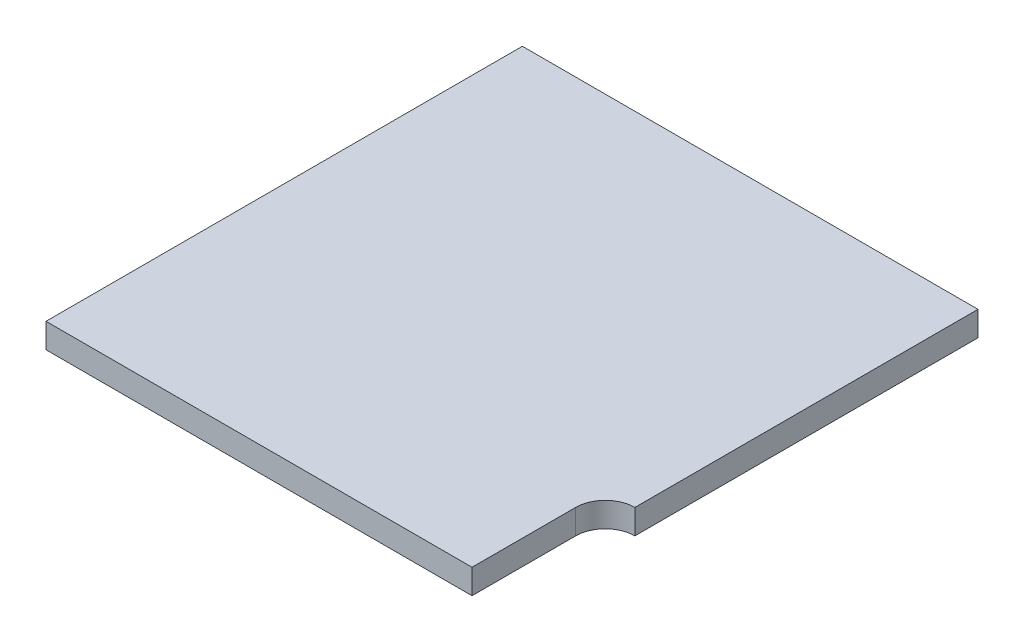
ISO-10303-21;
HEADER;
FILE_DESCRIPTION(('STEP AP214'),'2;1');
FILE_NAME('part.step','',(''),(''),'','','');
FILE_SCHEMA(('AUTOMOTIVE_DESIGN { 1 0 10303 214 1 1 1 1 }'));
ENDSEC;
DATA;
#1=APPLICATION_CONTEXT('core data for automotive mechanical design processes');
#2=APPLICATION_PROTOCOL_DEFINITION('international standard','automotive_design',2000,#1);
#3=PRODUCT_CONTEXT('',#1,'mechanical');
#4=PRODUCT('Part','Part','',(#3));
#5=PRODUCT_RELATED_PRODUCT_CATEGORY('part','',(#4));
#6=PRODUCT_DEFINITION_FORMATION('','',#4);
#7=PRODUCT_DEFINITION_CONTEXT('part definition',#1,'design');
#8=PRODUCT_DEFINITION('design','',#6,#7);
#9=PRODUCT_DEFINITION_SHAPE('','',#8);
#10=(LENGTH_UNIT() NAMED_UNIT(*) SI_UNIT(.MILLI.,.METRE.));
#11=(NAMED_UNIT(*) PLANE_ANGLE_UNIT() SI_UNIT($,.RADIAN.));
#12=(NAMED_UNIT(*) SI_UNIT($,.STERADIAN.) SOLID_ANGLE_UNIT());
#13=UNCERTAINTY_MEASURE_WITH_UNIT(LENGTH_MEASURE(1.E-05),#10,'distance_accuracy_value','');
#14=(GEOMETRIC_REPRESENTATION_CONTEXT(3) GLOBAL_UNCERTAINTY_ASSIGNED_CONTEXT((#13)) GLOBAL_UNIT_ASSIGNED_CONTEXT((#10,
#11,#12)) REPRESENTATION_CONTEXT('',''));
#15=CARTESIAN_POINT('',(0.,0.,0.));
#16=DIRECTION('',(0.,0.,1.));
#17=DIRECTION('',(1.,0.,0.));
#18=AXIS2_PLACEMENT_3D('',#15,#16,#17);
#19=CARTESIAN_POINT('',(9.23,1.,9.65));
#20=DIRECTION('',(-1.,0.,0.));
#21=DIRECTION('',(0.,0.,1.));
#22=AXIS2_PLACEMENT_3D('',#19,#20,#21);
#23=PLANE('',#22);
#24=DIRECTION('',(0.,0.,-1.));
#25=VECTOR('',#24,1.);
#26=CARTESIAN_POINT('',(9.23,1.,9.65));
#27=LINE('',#26,#25);
#28=CARTESIAN_POINT('',(9.23,1.,4.25));
#29=VERTEX_POINT('',#28);
#30=CARTESIAN_POINT('',(9.23,1.,-9.65));
#31=VERTEX_POINT('',#30);
#32=EDGE_CURVE('E80',#29,#31,#27,.T.);
#33=ORIENTED_EDGE('',*,*,#32,.F.);
#34=DIRECTION('',(0.,1.,0.));
#35=VECTOR('',#34,1.);
#36=CARTESIAN_POINT('',(9.23,0.,4.25));
#37=LINE('',#36,#35);
#38=CARTESIAN_POINT('',(9.23,0.,4.25));
#39=VERTEX_POINT('',#38);
#40=EDGE_CURVE('E100',#39,#29,#37,.T.);
#41=ORIENTED_EDGE('',*,*,#40,.F.);
#42=DIRECTION('',(0.,0.,-1.));
#43=VECTOR('',#42,1.);
#44=CARTESIAN_POINT('',(9.23,0.,9.65));
#45=LINE('',#44,#43);
#46=CARTESIAN_POINT('',(9.23,0.,-9.65));
#47=VERTEX_POINT('',#46);
#48=EDGE_CURVE('E108',#39,#47,#45,.T.);
#49=ORIENTED_EDGE('',*,*,#48,.T.);
#50=DIRECTION('',(0.,-1.,0.));
#51=VECTOR('',#50,1.);
#52=CARTESIAN_POINT('',(9.23,1.,-9.65));
#53=LINE('',#52,#51);
#54=EDGE_CURVE('E11',#31,#47,#53,.T.);
#55=ORIENTED_EDGE('',*,*,#54,.F.);
#56=EDGE_LOOP('',(#33,#41,#49,#55));
#57=FACE_BOUND('',#56,.T.);
#58=ADVANCED_FACE('F35',(#57),#23,.F.);
#59=CARTESIAN_POINT('',(-9.23,1.,-9.65));
#60=DIRECTION('',(0.,0.,1.));
#61=DIRECTION('',(1.,0.,0.));
#62=AXIS2_PLACEMENT_3D('',#59,#60,#61);
#63=PLANE('',#62);
#64=DIRECTION('',(-1.,0.,0.));
#65=VECTOR('',#64,1.);
#66=CARTESIAN_POINT('',(-9.23,0.,-9.65));
#67=LINE('',#66,#65);
#68=CARTESIAN_POINT('',(-9.23,0.,-9.65));
#69=VERTEX_POINT('',#68);
#70=EDGE_CURVE('E112',#47,#69,#67,.T.);
#71=ORIENTED_EDGE('',*,*,#70,.T.);
#72=DIRECTION('',(0.,-1.,0.));
#73=VECTOR('',#72,1.);
#74=CARTESIAN_POINT('',(-9.23,1.,-9.65));
#75=LINE('',#74,#73);
#76=CARTESIAN_POINT('',(-9.23,1.,-9.65));
#77=VERTEX_POINT('',#76);
#78=EDGE_CURVE('E42',#77,#69,#75,.T.);
#79=ORIENTED_EDGE('',*,*,#78,.F.);
#80=DIRECTION('',(-1.,0.,0.));
#81=VECTOR('',#80,1.);
#82=CARTESIAN_POINT('',(-9.23,1.,-9.65));
#83=LINE('',#82,#81);
#84=EDGE_CURVE('E135',#31,#77,#83,.T.);
#85=ORIENTED_EDGE('',*,*,#84,.F.);
#86=ORIENTED_EDGE('',*,*,#54,.T.);
#87=EDGE_LOOP('',(#71,#79,#85,#86));
#88=FACE_BOUND('',#87,.T.);
#89=ADVANCED_FACE('F154',(#88),#63,.F.);
#90=CARTESIAN_POINT('',(-9.23,1.,9.65));
#91=DIRECTION('',(1.,0.,0.));
#92=DIRECTION('',(0.,0.,-1.));
#93=AXIS2_PLACEMENT_3D('',#90,#91,#92);
#94=PLANE('',#93);
#95=DIRECTION('',(0.,0.,1.));
#96=VECTOR('',#95,1.);
#97=CARTESIAN_POINT('',(-9.23,0.,9.65));
#98=LINE('',#97,#96);
#99=CARTESIAN_POINT('',(-9.23,0.,9.65));
#100=VERTEX_POINT('',#99);
#101=EDGE_CURVE('E75',#69,#100,#98,.T.);
#102=ORIENTED_EDGE('',*,*,#101,.T.);
#103=DIRECTION('',(0.,-1.,0.));
#104=VECTOR('',#103,1.);
#105=CARTESIAN_POINT('',(-9.23,1.,9.65));
#106=LINE('',#105,#104);
#107=CARTESIAN_POINT('',(-9.23,1.,9.65));
#108=VERTEX_POINT('',#107);
#109=EDGE_CURVE('E126',#108,#100,#106,.T.);
#110=ORIENTED_EDGE('',*,*,#109,.F.);
#111=DIRECTION('',(0.,0.,1.));
#112=VECTOR('',#111,1.);
#113=CARTESIAN_POINT('',(-9.23,1.,9.65));
#114=LINE('',#113,#112);
#115=EDGE_CURVE('E58',#77,#108,#114,.T.);
#116=ORIENTED_EDGE('',*,*,#115,.F.);
#117=ORIENTED_EDGE('',*,*,#78,.T.);
#118=EDGE_LOOP('',(#102,#110,#116,#117));
#119=FACE_BOUND('',#118,.T.);
#120=ADVANCED_FACE('F128',(#119),#94,.F.);
#121=CARTESIAN_POINT('',(-9.23,1.,9.65));
#122=DIRECTION('',(0.,0.,-1.));
#123=DIRECTION('',(-1.,0.,0.));
#124=AXIS2_PLACEMENT_3D('',#121,#122,#123);
#125=PLANE('',#124);
#126=DIRECTION('',(1.,0.,0.));
#127=VECTOR('',#126,1.);
#128=CARTESIAN_POINT('',(-9.23,0.,9.65));
#129=LINE('',#128,#127);
#130=CARTESIAN_POINT('',(8.03,0.,9.65));
#131=VERTEX_POINT('',#130);
#132=EDGE_CURVE('E123',#100,#131,#129,.T.);
#133=ORIENTED_EDGE('',*,*,#132,.T.);
#134=DIRECTION('',(0.,1.,0.));
#135=VECTOR('',#134,1.);
#136=CARTESIAN_POINT('',(8.03,0.,9.65));
#137=LINE('',#136,#135);
#138=CARTESIAN_POINT('',(8.03,1.,9.65));
#139=VERTEX_POINT('',#138);
#140=EDGE_CURVE('E113',#131,#139,#137,.T.);
#141=ORIENTED_EDGE('',*,*,#140,.T.);
#142=DIRECTION('',(1.,0.,0.));
#143=VECTOR('',#142,1.);
#144=CARTESIAN_POINT('',(-9.23,1.,9.65));
#145=LINE('',#144,#143);
#146=EDGE_CURVE('E119',#108,#139,#145,.T.);
#147=ORIENTED_EDGE('',*,*,#146,.F.);
#148=ORIENTED_EDGE('',*,*,#109,.T.);
#149=EDGE_LOOP('',(#133,#141,#147,#148));
#150=FACE_BOUND('',#149,.T.);
#151=ADVANCED_FACE('F132',(#150),#125,.F.);
#152=CARTESIAN_POINT('',(0.,1.,0.));
#153=DIRECTION('',(0.,-1.,0.));
#154=DIRECTION('',(0.,0.,-1.));
#155=AXIS2_PLACEMENT_3D('',#152,#153,#154);
#156=PLANE('',#155);
#157=ORIENTED_EDGE('',*,*,#146,.T.);
#158=DIRECTION('',(0.,0.,1.));
#159=VECTOR('',#158,1.);
#160=CARTESIAN_POINT('',(8.03,1.,9.65));
#161=LINE('',#160,#159);
#162=CARTESIAN_POINT('',(8.03,1.,5.45));
#163=VERTEX_POINT('',#162);
#164=EDGE_CURVE('E104',#163,#139,#161,.T.);
#165=ORIENTED_EDGE('',*,*,#164,.F.);
#166=CARTESIAN_POINT('',(9.23,1.,5.45));
#167=DIRECTION('',(0.,1.,0.));
#168=DIRECTION('',(0.,0.,-1.));
#169=AXIS2_PLACEMENT_3D('',#166,#167,#168);
#170=CIRCLE('',#169,1.2);
#171=EDGE_CURVE('E141',#29,#163,#170,.T.);
#172=ORIENTED_EDGE('',*,*,#171,.F.);
#173=ORIENTED_EDGE('',*,*,#32,.T.);
#174=ORIENTED_EDGE('',*,*,#84,.T.);
#175=ORIENTED_EDGE('',*,*,#115,.T.);
#176=EDGE_LOOP('',(#157,#165,#172,#173,#174,#175));
#177=FACE_BOUND('',#176,.T.);
#178=ADVANCED_FACE('F143',(#177),#156,.F.);
#179=CARTESIAN_POINT('',(0.,0.,0.));
#180=DIRECTION('',(0.,-1.,0.));
#181=DIRECTION('',(0.,0.,-1.));
#182=AXIS2_PLACEMENT_3D('',#179,#180,#181);
#183=PLANE('',#182);
#184=DIRECTION('',(0.,0.,1.));
#185=VECTOR('',#184,1.);
#186=CARTESIAN_POINT('',(8.03,0.,9.65));
#187=LINE('',#186,#185);
#188=CARTESIAN_POINT('',(8.03,0.,5.45));
#189=VERTEX_POINT('',#188);
#190=EDGE_CURVE('E49',#189,#131,#187,.T.);
#191=ORIENTED_EDGE('',*,*,#190,.T.);
#192=ORIENTED_EDGE('',*,*,#132,.F.);
#193=ORIENTED_EDGE('',*,*,#101,.F.);
#194=ORIENTED_EDGE('',*,*,#70,.F.);
#195=ORIENTED_EDGE('',*,*,#48,.F.);
#196=CARTESIAN_POINT('',(9.23,0.,5.45));
#197=DIRECTION('',(0.,1.,0.));
#198=DIRECTION('',(0.,0.,-1.));
#199=AXIS2_PLACEMENT_3D('',#196,#197,#198);
#200=CIRCLE('',#199,1.2);
#201=EDGE_CURVE('E96',#39,#189,#200,.T.);
#202=ORIENTED_EDGE('',*,*,#201,.T.);
#203=EDGE_LOOP('',(#191,#192,#193,#194,#195,#202));
#204=FACE_BOUND('',#203,.T.);
#205=ADVANCED_FACE('F111',(#204),#183,.T.);
#206=CARTESIAN_POINT('',(8.03,0.,9.65));
#207=DIRECTION('',(-1.,0.,0.));
#208=DIRECTION('',(0.,0.,1.));
#209=AXIS2_PLACEMENT_3D('',#206,#207,#208);
#210=PLANE('',#209);
#211=ORIENTED_EDGE('',*,*,#164,.T.);
#212=ORIENTED_EDGE('',*,*,#140,.F.);
#213=ORIENTED_EDGE('',*,*,#190,.F.);
#214=DIRECTION('',(0.,1.,0.));
#215=VECTOR('',#214,1.);
#216=CARTESIAN_POINT('',(8.03,0.,5.45));
#217=LINE('',#216,#215);
#218=EDGE_CURVE('E101',#189,#163,#217,.T.);
#219=ORIENTED_EDGE('',*,*,#218,.T.);
#220=EDGE_LOOP('',(#211,#212,#213,#219));
#221=FACE_BOUND('',#220,.T.);
#222=ADVANCED_FACE('F144',(#221),#210,.F.);
#223=CARTESIAN_POINT('',(9.23,0.,5.45));
#224=DIRECTION('',(0.,1.,0.));
#225=DIRECTION('',(0.,0.,1.));
#226=AXIS2_PLACEMENT_3D('',#223,#224,#225);
#227=CYLINDRICAL_SURFACE('',#226,1.2);
#228=ORIENTED_EDGE('',*,*,#171,.T.);
#229=ORIENTED_EDGE('',*,*,#218,.F.);
#230=ORIENTED_EDGE('',*,*,#201,.F.);
#231=ORIENTED_EDGE('',*,*,#40,.T.);
#232=EDGE_LOOP('',(#228,#229,#230,#231));
#233=FACE_BOUND('',#232,.T.);
#234=ADVANCED_FACE('F99',(#233),#227,.F.);
#235=CLOSED_SHELL('',(#58,#89,#120,#151,#178,#205,#222,#234));
#236=MANIFOLD_SOLID_BREP('B2',#235);
#237=ADVANCED_BREP_SHAPE_REPRESENTATION('',(#18,#236),#14);
#238=SHAPE_DEFINITION_REPRESENTATION(#9,#237);
ENDSEC;
END-ISO-10303-21;
